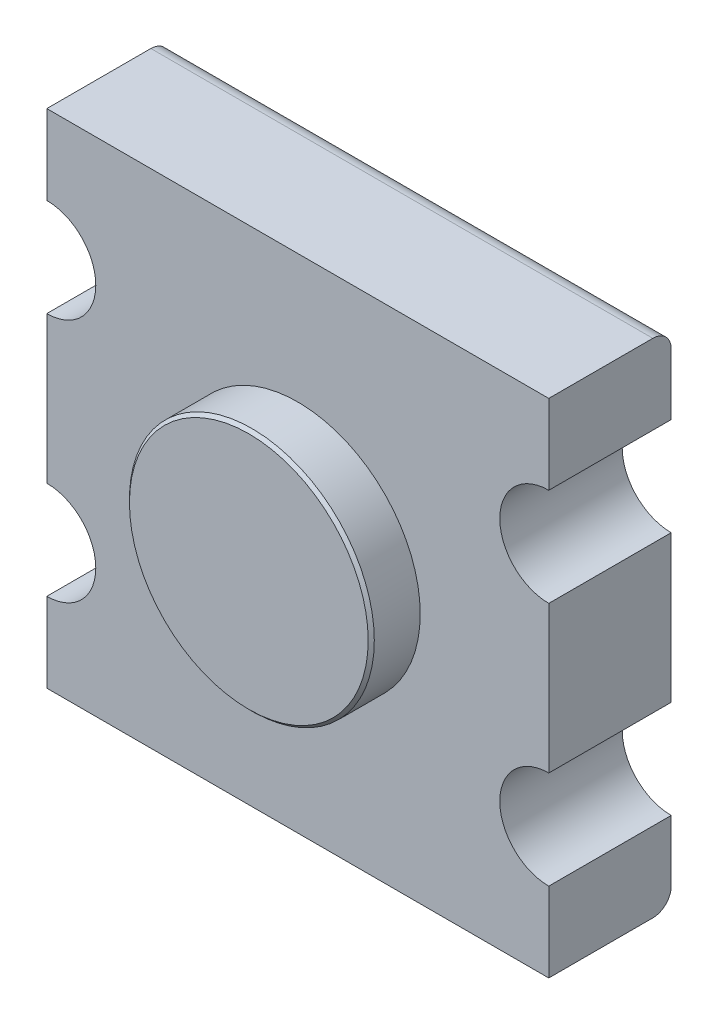
ISO-10303-21;
HEADER;
FILE_DESCRIPTION(('STEP AP214'),'2;1');
FILE_NAME('part.step','',(''),(''),'','','');
FILE_SCHEMA(('AUTOMOTIVE_DESIGN { 1 0 10303 214 1 1 1 1 }'));
ENDSEC;
DATA;
#1=APPLICATION_CONTEXT('core data for automotive mechanical design processes');
#2=APPLICATION_PROTOCOL_DEFINITION('international standard','automotive_design',2000,#1);
#3=PRODUCT_CONTEXT('',#1,'mechanical');
#4=PRODUCT('Part','Part','',(#3));
#5=PRODUCT_RELATED_PRODUCT_CATEGORY('part','',(#4));
#6=PRODUCT_DEFINITION_FORMATION('','',#4);
#7=PRODUCT_DEFINITION_CONTEXT('part definition',#1,'design');
#8=PRODUCT_DEFINITION('design','',#6,#7);
#9=PRODUCT_DEFINITION_SHAPE('','',#8);
#10=(LENGTH_UNIT() NAMED_UNIT(*) SI_UNIT(.MILLI.,.METRE.));
#11=(NAMED_UNIT(*) PLANE_ANGLE_UNIT() SI_UNIT($,.RADIAN.));
#12=(NAMED_UNIT(*) SI_UNIT($,.STERADIAN.) SOLID_ANGLE_UNIT());
#13=UNCERTAINTY_MEASURE_WITH_UNIT(LENGTH_MEASURE(1.E-05),#10,'distance_accuracy_value','');
#14=(GEOMETRIC_REPRESENTATION_CONTEXT(3) GLOBAL_UNCERTAINTY_ASSIGNED_CONTEXT((#13)) GLOBAL_UNIT_ASSIGNED_CONTEXT((#10,
#11,#12)) REPRESENTATION_CONTEXT('',''));
#15=CARTESIAN_POINT('',(0.,0.,0.));
#16=DIRECTION('',(0.,0.,1.));
#17=DIRECTION('',(1.,0.,0.));
#18=AXIS2_PLACEMENT_3D('',#15,#16,#17);
#19=CARTESIAN_POINT('',(0.,0.,20.));
#20=DIRECTION('',(1.,0.,0.));
#21=DIRECTION('',(0.,0.,-1.));
#22=AXIS2_PLACEMENT_3D('',#19,#20,#21);
#23=PLANE('',#22);
#24=DIRECTION('',(0.,-1.,0.));
#25=VECTOR('',#24,1.);
#26=CARTESIAN_POINT('',(0.,0.,0.));
#27=LINE('',#26,#25);
#28=CARTESIAN_POINT('',(0.,13.,0.));
#29=VERTEX_POINT('',#28);
#30=CARTESIAN_POINT('',(0.,3.,0.));
#31=VERTEX_POINT('',#30);
#32=EDGE_CURVE('E269',#29,#31,#27,.T.);
#33=ORIENTED_EDGE('',*,*,#32,.T.);
#34=CARTESIAN_POINT('',(0.,3.,3.));
#35=DIRECTION('',(1.,0.,0.));
#36=DIRECTION('',(0.,0.,-1.));
#37=AXIS2_PLACEMENT_3D('',#34,#35,#36);
#38=CIRCLE('',#37,3.);
#39=CARTESIAN_POINT('',(0.,0.,3.));
#40=VERTEX_POINT('',#39);
#41=EDGE_CURVE('E170',#31,#40,#38,.F.);
#42=ORIENTED_EDGE('',*,*,#41,.T.);
#43=DIRECTION('',(0.,0.,-1.));
#44=VECTOR('',#43,1.);
#45=CARTESIAN_POINT('',(0.,0.,20.));
#46=LINE('',#45,#44);
#47=CARTESIAN_POINT('',(0.,0.,20.));
#48=VERTEX_POINT('',#47);
#49=EDGE_CURVE('E148',#48,#40,#46,.T.);
#50=ORIENTED_EDGE('',*,*,#49,.F.);
#51=DIRECTION('',(0.,-1.,0.));
#52=VECTOR('',#51,1.);
#53=CARTESIAN_POINT('',(0.,0.,20.));
#54=LINE('',#53,#52);
#55=CARTESIAN_POINT('',(0.,13.,20.));
#56=VERTEX_POINT('',#55);
#57=EDGE_CURVE('E156',#56,#48,#54,.T.);
#58=ORIENTED_EDGE('',*,*,#57,.F.);
#59=DIRECTION('',(0.,0.,-1.));
#60=VECTOR('',#59,1.);
#61=CARTESIAN_POINT('',(0.,13.,20.));
#62=LINE('',#61,#60);
#63=EDGE_CURVE('E284',#56,#29,#62,.T.);
#64=ORIENTED_EDGE('',*,*,#63,.T.);
#65=EDGE_LOOP('',(#33,#42,#50,#58,#64));
#66=FACE_BOUND('',#65,.T.);
#67=ADVANCED_FACE('F41',(#66),#23,.F.);
#68=CARTESIAN_POINT('',(0.,0.,20.));
#69=DIRECTION('',(0.,1.,0.));
#70=DIRECTION('',(0.,0.,1.));
#71=AXIS2_PLACEMENT_3D('',#68,#69,#70);
#72=PLANE('',#71);
#73=ORIENTED_EDGE('',*,*,#49,.T.);
#74=DIRECTION('',(1.,0.,0.));
#75=VECTOR('',#74,1.);
#76=CARTESIAN_POINT('',(0.,0.,3.));
#77=LINE('',#76,#75);
#78=CARTESIAN_POINT('',(82.,0.,3.));
#79=VERTEX_POINT('',#78);
#80=EDGE_CURVE('E186',#40,#79,#77,.T.);
#81=ORIENTED_EDGE('',*,*,#80,.T.);
#82=DIRECTION('',(0.,0.,-1.));
#83=VECTOR('',#82,1.);
#84=CARTESIAN_POINT('',(82.,0.,20.));
#85=LINE('',#84,#83);
#86=CARTESIAN_POINT('',(82.,0.,20.));
#87=VERTEX_POINT('',#86);
#88=EDGE_CURVE('E151',#87,#79,#85,.T.);
#89=ORIENTED_EDGE('',*,*,#88,.F.);
#90=DIRECTION('',(1.,0.,0.));
#91=VECTOR('',#90,1.);
#92=CARTESIAN_POINT('',(0.,0.,20.));
#93=LINE('',#92,#91);
#94=EDGE_CURVE('E143',#48,#87,#93,.T.);
#95=ORIENTED_EDGE('',*,*,#94,.F.);
#96=EDGE_LOOP('',(#73,#81,#89,#95));
#97=FACE_BOUND('',#96,.T.);
#98=ADVANCED_FACE('F145',(#97),#72,.F.);
#99=CARTESIAN_POINT('',(82.,0.,20.));
#100=DIRECTION('',(-1.,0.,0.));
#101=DIRECTION('',(0.,0.,1.));
#102=AXIS2_PLACEMENT_3D('',#99,#100,#101);
#103=PLANE('',#102);
#104=ORIENTED_EDGE('',*,*,#88,.T.);
#105=CARTESIAN_POINT('',(82.,3.,3.));
#106=DIRECTION('',(-1.,0.,0.));
#107=DIRECTION('',(0.,0.,1.));
#108=AXIS2_PLACEMENT_3D('',#105,#106,#107);
#109=CIRCLE('',#108,3.);
#110=CARTESIAN_POINT('',(82.,3.,0.));
#111=VERTEX_POINT('',#110);
#112=EDGE_CURVE('E189',#79,#111,#109,.F.);
#113=ORIENTED_EDGE('',*,*,#112,.T.);
#114=DIRECTION('',(0.,1.,0.));
#115=VECTOR('',#114,1.);
#116=CARTESIAN_POINT('',(82.,0.,0.));
#117=LINE('',#116,#115);
#118=CARTESIAN_POINT('',(82.,13.,0.));
#119=VERTEX_POINT('',#118);
#120=EDGE_CURVE('E259',#111,#119,#117,.T.);
#121=ORIENTED_EDGE('',*,*,#120,.T.);
#122=DIRECTION('',(0.,0.,-1.));
#123=VECTOR('',#122,1.);
#124=CARTESIAN_POINT('',(82.,13.,20.));
#125=LINE('',#124,#123);
#126=CARTESIAN_POINT('',(82.,13.,20.));
#127=VERTEX_POINT('',#126);
#128=EDGE_CURVE('E179',#127,#119,#125,.T.);
#129=ORIENTED_EDGE('',*,*,#128,.F.);
#130=DIRECTION('',(0.,1.,0.));
#131=VECTOR('',#130,1.);
#132=CARTESIAN_POINT('',(82.,0.,20.));
#133=LINE('',#132,#131);
#134=EDGE_CURVE('E155',#87,#127,#133,.T.);
#135=ORIENTED_EDGE('',*,*,#134,.F.);
#136=EDGE_LOOP('',(#104,#113,#121,#129,#135));
#137=FACE_BOUND('',#136,.T.);
#138=ADVANCED_FACE('F342',(#137),#103,.F.);
#139=CARTESIAN_POINT('',(82.,21.,20.));
#140=DIRECTION('',(0.,0.,-1.));
#141=DIRECTION('',(-1.,0.,0.));
#142=AXIS2_PLACEMENT_3D('',#139,#140,#141);
#143=CYLINDRICAL_SURFACE('',#142,8.);
#144=CARTESIAN_POINT('',(82.,21.,0.));
#145=DIRECTION('',(0.,0.,-1.));
#146=DIRECTION('',(1.,0.,0.));
#147=AXIS2_PLACEMENT_3D('',#144,#145,#146);
#148=CIRCLE('',#147,8.);
#149=CARTESIAN_POINT('',(82.,29.,0.));
#150=VERTEX_POINT('',#149);
#151=EDGE_CURVE('E255',#119,#150,#148,.T.);
#152=ORIENTED_EDGE('',*,*,#151,.T.);
#153=DIRECTION('',(0.,0.,-1.));
#154=VECTOR('',#153,1.);
#155=CARTESIAN_POINT('',(82.,29.,20.));
#156=LINE('',#155,#154);
#157=CARTESIAN_POINT('',(82.,29.,20.));
#158=VERTEX_POINT('',#157);
#159=EDGE_CURVE('E244',#158,#150,#156,.T.);
#160=ORIENTED_EDGE('',*,*,#159,.F.);
#161=CARTESIAN_POINT('',(82.,21.,20.));
#162=DIRECTION('',(0.,0.,-1.));
#163=DIRECTION('',(1.,0.,0.));
#164=AXIS2_PLACEMENT_3D('',#161,#162,#163);
#165=CIRCLE('',#164,8.);
#166=EDGE_CURVE('E256',#127,#158,#165,.T.);
#167=ORIENTED_EDGE('',*,*,#166,.F.);
#168=ORIENTED_EDGE('',*,*,#128,.T.);
#169=EDGE_LOOP('',(#152,#160,#167,#168));
#170=FACE_BOUND('',#169,.T.);
#171=ADVANCED_FACE('F253',(#170),#143,.F.);
#172=CARTESIAN_POINT('',(82.,29.,20.));
#173=DIRECTION('',(-1.,0.,0.));
#174=DIRECTION('',(0.,0.,1.));
#175=AXIS2_PLACEMENT_3D('',#172,#173,#174);
#176=PLANE('',#175);
#177=DIRECTION('',(0.,1.,0.));
#178=VECTOR('',#177,1.);
#179=CARTESIAN_POINT('',(82.,29.,0.));
#180=LINE('',#179,#178);
#181=CARTESIAN_POINT('',(82.,53.,0.));
#182=VERTEX_POINT('',#181);
#183=EDGE_CURVE('E262',#150,#182,#180,.T.);
#184=ORIENTED_EDGE('',*,*,#183,.T.);
#185=DIRECTION('',(0.,0.,-1.));
#186=VECTOR('',#185,1.);
#187=CARTESIAN_POINT('',(82.,53.,20.));
#188=LINE('',#187,#186);
#189=CARTESIAN_POINT('',(82.,53.,20.));
#190=VERTEX_POINT('',#189);
#191=EDGE_CURVE('E235',#190,#182,#188,.T.);
#192=ORIENTED_EDGE('',*,*,#191,.F.);
#193=DIRECTION('',(0.,1.,0.));
#194=VECTOR('',#193,1.);
#195=CARTESIAN_POINT('',(82.,29.,20.));
#196=LINE('',#195,#194);
#197=EDGE_CURVE('E327',#158,#190,#196,.T.);
#198=ORIENTED_EDGE('',*,*,#197,.F.);
#199=ORIENTED_EDGE('',*,*,#159,.T.);
#200=EDGE_LOOP('',(#184,#192,#198,#199));
#201=FACE_BOUND('',#200,.T.);
#202=ADVANCED_FACE('F341',(#201),#176,.F.);
#203=CARTESIAN_POINT('',(82.,61.,20.));
#204=DIRECTION('',(0.,0.,-1.));
#205=DIRECTION('',(-1.,0.,0.));
#206=AXIS2_PLACEMENT_3D('',#203,#204,#205);
#207=CYLINDRICAL_SURFACE('',#206,8.);
#208=CARTESIAN_POINT('',(82.,61.,0.));
#209=DIRECTION('',(0.,0.,-1.));
#210=DIRECTION('',(1.,0.,0.));
#211=AXIS2_PLACEMENT_3D('',#208,#209,#210);
#212=CIRCLE('',#211,8.);
#213=CARTESIAN_POINT('',(82.,69.,0.));
#214=VERTEX_POINT('',#213);
#215=EDGE_CURVE('E267',#182,#214,#212,.T.);
#216=ORIENTED_EDGE('',*,*,#215,.T.);
#217=DIRECTION('',(0.,0.,-1.));
#218=VECTOR('',#217,1.);
#219=CARTESIAN_POINT('',(82.,69.,20.));
#220=LINE('',#219,#218);
#221=CARTESIAN_POINT('',(82.,69.,20.));
#222=VERTEX_POINT('',#221);
#223=EDGE_CURVE('E230',#222,#214,#220,.T.);
#224=ORIENTED_EDGE('',*,*,#223,.F.);
#225=CARTESIAN_POINT('',(82.,61.,20.));
#226=DIRECTION('',(0.,0.,-1.));
#227=DIRECTION('',(1.,0.,0.));
#228=AXIS2_PLACEMENT_3D('',#225,#226,#227);
#229=CIRCLE('',#228,8.);
#230=EDGE_CURVE('E330',#190,#222,#229,.T.);
#231=ORIENTED_EDGE('',*,*,#230,.F.);
#232=ORIENTED_EDGE('',*,*,#191,.T.);
#233=EDGE_LOOP('',(#216,#224,#231,#232));
#234=FACE_BOUND('',#233,.T.);
#235=ADVANCED_FACE('F337',(#234),#207,.F.);
#236=CARTESIAN_POINT('',(82.,69.,20.));
#237=DIRECTION('',(-1.,0.,0.));
#238=DIRECTION('',(0.,0.,1.));
#239=AXIS2_PLACEMENT_3D('',#236,#237,#238);
#240=PLANE('',#239);
#241=DIRECTION('',(0.,1.,0.));
#242=VECTOR('',#241,1.);
#243=CARTESIAN_POINT('',(82.,69.,0.));
#244=LINE('',#243,#242);
#245=CARTESIAN_POINT('',(82.,79.,0.));
#246=VERTEX_POINT('',#245);
#247=EDGE_CURVE('E221',#214,#246,#244,.T.);
#248=ORIENTED_EDGE('',*,*,#247,.T.);
#249=CARTESIAN_POINT('',(82.,79.,3.));
#250=DIRECTION('',(-1.,0.,0.));
#251=DIRECTION('',(0.,0.,1.));
#252=AXIS2_PLACEMENT_3D('',#249,#250,#251);
#253=CIRCLE('',#252,3.);
#254=CARTESIAN_POINT('',(82.,82.,3.));
#255=VERTEX_POINT('',#254);
#256=EDGE_CURVE('E11',#246,#255,#253,.F.);
#257=ORIENTED_EDGE('',*,*,#256,.T.);
#258=DIRECTION('',(0.,0.,-1.));
#259=VECTOR('',#258,1.);
#260=CARTESIAN_POINT('',(82.,82.,20.));
#261=LINE('',#260,#259);
#262=CARTESIAN_POINT('',(82.,82.,20.));
#263=VERTEX_POINT('',#262);
#264=EDGE_CURVE('E226',#263,#255,#261,.T.);
#265=ORIENTED_EDGE('',*,*,#264,.F.);
#266=DIRECTION('',(0.,1.,0.));
#267=VECTOR('',#266,1.);
#268=CARTESIAN_POINT('',(82.,69.,20.));
#269=LINE('',#268,#267);
#270=EDGE_CURVE('E307',#222,#263,#269,.T.);
#271=ORIENTED_EDGE('',*,*,#270,.F.);
#272=ORIENTED_EDGE('',*,*,#223,.T.);
#273=EDGE_LOOP('',(#248,#257,#265,#271,#272));
#274=FACE_BOUND('',#273,.T.);
#275=ADVANCED_FACE('F335',(#274),#240,.F.);
#276=CARTESIAN_POINT('',(0.,82.,20.));
#277=DIRECTION('',(0.,-1.,0.));
#278=DIRECTION('',(0.,0.,-1.));
#279=AXIS2_PLACEMENT_3D('',#276,#277,#278);
#280=PLANE('',#279);
#281=ORIENTED_EDGE('',*,*,#264,.T.);
#282=DIRECTION('',(-1.,0.,0.));
#283=VECTOR('',#282,1.);
#284=CARTESIAN_POINT('',(0.,82.,3.));
#285=LINE('',#284,#283);
#286=CARTESIAN_POINT('',(0.,82.,3.));
#287=VERTEX_POINT('',#286);
#288=EDGE_CURVE('E200',#255,#287,#285,.T.);
#289=ORIENTED_EDGE('',*,*,#288,.T.);
#290=DIRECTION('',(0.,0.,-1.));
#291=VECTOR('',#290,1.);
#292=CARTESIAN_POINT('',(0.,82.,20.));
#293=LINE('',#292,#291);
#294=CARTESIAN_POINT('',(0.,82.,20.));
#295=VERTEX_POINT('',#294);
#296=EDGE_CURVE('E212',#295,#287,#293,.T.);
#297=ORIENTED_EDGE('',*,*,#296,.F.);
#298=DIRECTION('',(-1.,0.,0.));
#299=VECTOR('',#298,1.);
#300=CARTESIAN_POINT('',(0.,82.,20.));
#301=LINE('',#300,#299);
#302=EDGE_CURVE('E227',#263,#295,#301,.T.);
#303=ORIENTED_EDGE('',*,*,#302,.F.);
#304=EDGE_LOOP('',(#281,#289,#297,#303));
#305=FACE_BOUND('',#304,.T.);
#306=ADVANCED_FACE('F224',(#305),#280,.F.);
#307=CARTESIAN_POINT('',(0.,69.,20.));
#308=DIRECTION('',(1.,0.,0.));
#309=DIRECTION('',(0.,0.,-1.));
#310=AXIS2_PLACEMENT_3D('',#307,#308,#309);
#311=PLANE('',#310);
#312=ORIENTED_EDGE('',*,*,#296,.T.);
#313=CARTESIAN_POINT('',(0.,79.,3.));
#314=DIRECTION('',(1.,0.,0.));
#315=DIRECTION('',(0.,0.,-1.));
#316=AXIS2_PLACEMENT_3D('',#313,#314,#315);
#317=CIRCLE('',#316,3.);
#318=CARTESIAN_POINT('',(0.,79.,0.));
#319=VERTEX_POINT('',#318);
#320=EDGE_CURVE('E50',#287,#319,#317,.F.);
#321=ORIENTED_EDGE('',*,*,#320,.T.);
#322=DIRECTION('',(0.,-1.,0.));
#323=VECTOR('',#322,1.);
#324=CARTESIAN_POINT('',(0.,69.,0.));
#325=LINE('',#324,#323);
#326=CARTESIAN_POINT('',(0.,69.,0.));
#327=VERTEX_POINT('',#326);
#328=EDGE_CURVE('E208',#319,#327,#325,.T.);
#329=ORIENTED_EDGE('',*,*,#328,.T.);
#330=DIRECTION('',(0.,0.,-1.));
#331=VECTOR('',#330,1.);
#332=CARTESIAN_POINT('',(0.,69.,20.));
#333=LINE('',#332,#331);
#334=CARTESIAN_POINT('',(0.,69.,20.));
#335=VERTEX_POINT('',#334);
#336=EDGE_CURVE('E237',#335,#327,#333,.T.);
#337=ORIENTED_EDGE('',*,*,#336,.F.);
#338=DIRECTION('',(0.,-1.,0.));
#339=VECTOR('',#338,1.);
#340=CARTESIAN_POINT('',(0.,69.,20.));
#341=LINE('',#340,#339);
#342=EDGE_CURVE('E300',#295,#335,#341,.T.);
#343=ORIENTED_EDGE('',*,*,#342,.F.);
#344=EDGE_LOOP('',(#312,#321,#329,#337,#343));
#345=FACE_BOUND('',#344,.T.);
#346=ADVANCED_FACE('F206',(#345),#311,.F.);
#347=CARTESIAN_POINT('',(0.,61.,20.));
#348=DIRECTION('',(0.,0.,-1.));
#349=DIRECTION('',(-1.,0.,0.));
#350=AXIS2_PLACEMENT_3D('',#347,#348,#349);
#351=CYLINDRICAL_SURFACE('',#350,8.);
#352=CARTESIAN_POINT('',(0.,61.,0.));
#353=DIRECTION('',(0.,0.,-1.));
#354=DIRECTION('',(1.,0.,0.));
#355=AXIS2_PLACEMENT_3D('',#352,#353,#354);
#356=CIRCLE('',#355,8.);
#357=CARTESIAN_POINT('',(0.,53.,0.));
#358=VERTEX_POINT('',#357);
#359=EDGE_CURVE('E219',#327,#358,#356,.T.);
#360=ORIENTED_EDGE('',*,*,#359,.T.);
#361=DIRECTION('',(0.,0.,-1.));
#362=VECTOR('',#361,1.);
#363=CARTESIAN_POINT('',(0.,53.,20.));
#364=LINE('',#363,#362);
#365=CARTESIAN_POINT('',(0.,53.,20.));
#366=VERTEX_POINT('',#365);
#367=EDGE_CURVE('E291',#366,#358,#364,.T.);
#368=ORIENTED_EDGE('',*,*,#367,.F.);
#369=CARTESIAN_POINT('',(0.,61.,20.));
#370=DIRECTION('',(0.,0.,-1.));
#371=DIRECTION('',(1.,0.,0.));
#372=AXIS2_PLACEMENT_3D('',#369,#370,#371);
#373=CIRCLE('',#372,8.);
#374=EDGE_CURVE('E299',#335,#366,#373,.T.);
#375=ORIENTED_EDGE('',*,*,#374,.F.);
#376=ORIENTED_EDGE('',*,*,#336,.T.);
#377=EDGE_LOOP('',(#360,#368,#375,#376));
#378=FACE_BOUND('',#377,.T.);
#379=ADVANCED_FACE('F297',(#378),#351,.F.);
#380=CARTESIAN_POINT('',(0.,29.,20.));
#381=DIRECTION('',(1.,0.,0.));
#382=DIRECTION('',(0.,0.,-1.));
#383=AXIS2_PLACEMENT_3D('',#380,#381,#382);
#384=PLANE('',#383);
#385=DIRECTION('',(0.,-1.,0.));
#386=VECTOR('',#385,1.);
#387=CARTESIAN_POINT('',(0.,29.,0.));
#388=LINE('',#387,#386);
#389=CARTESIAN_POINT('',(0.,29.,0.));
#390=VERTEX_POINT('',#389);
#391=EDGE_CURVE('E279',#358,#390,#388,.T.);
#392=ORIENTED_EDGE('',*,*,#391,.T.);
#393=DIRECTION('',(0.,0.,-1.));
#394=VECTOR('',#393,1.);
#395=CARTESIAN_POINT('',(0.,29.,20.));
#396=LINE('',#395,#394);
#397=CARTESIAN_POINT('',(0.,29.,20.));
#398=VERTEX_POINT('',#397);
#399=EDGE_CURVE('E287',#398,#390,#396,.T.);
#400=ORIENTED_EDGE('',*,*,#399,.F.);
#401=DIRECTION('',(0.,-1.,0.));
#402=VECTOR('',#401,1.);
#403=CARTESIAN_POINT('',(0.,29.,20.));
#404=LINE('',#403,#402);
#405=EDGE_CURVE('E305',#366,#398,#404,.T.);
#406=ORIENTED_EDGE('',*,*,#405,.F.);
#407=ORIENTED_EDGE('',*,*,#367,.T.);
#408=EDGE_LOOP('',(#392,#400,#406,#407));
#409=FACE_BOUND('',#408,.T.);
#410=ADVANCED_FACE('F351',(#409),#384,.F.);
#411=CARTESIAN_POINT('',(0.,21.,20.));
#412=DIRECTION('',(0.,0.,-1.));
#413=DIRECTION('',(-1.,0.,0.));
#414=AXIS2_PLACEMENT_3D('',#411,#412,#413);
#415=CYLINDRICAL_SURFACE('',#414,8.);
#416=CARTESIAN_POINT('',(0.,21.,0.));
#417=DIRECTION('',(0.,0.,-1.));
#418=DIRECTION('',(1.,0.,0.));
#419=AXIS2_PLACEMENT_3D('',#416,#417,#418);
#420=CIRCLE('',#419,8.);
#421=EDGE_CURVE('E166',#390,#29,#420,.T.);
#422=ORIENTED_EDGE('',*,*,#421,.T.);
#423=ORIENTED_EDGE('',*,*,#63,.F.);
#424=CARTESIAN_POINT('',(0.,21.,20.));
#425=DIRECTION('',(0.,0.,-1.));
#426=DIRECTION('',(1.,0.,0.));
#427=AXIS2_PLACEMENT_3D('',#424,#425,#426);
#428=CIRCLE('',#427,8.);
#429=EDGE_CURVE('E161',#398,#56,#428,.T.);
#430=ORIENTED_EDGE('',*,*,#429,.F.);
#431=ORIENTED_EDGE('',*,*,#399,.T.);
#432=EDGE_LOOP('',(#422,#423,#430,#431));
#433=FACE_BOUND('',#432,.T.);
#434=ADVANCED_FACE('F347',(#433),#415,.F.);
#435=CARTESIAN_POINT('',(0.,21.,20.));
#436=DIRECTION('',(0.,0.,1.));
#437=DIRECTION('',(1.,0.,0.));
#438=AXIS2_PLACEMENT_3D('',#435,#436,#437);
#439=PLANE('',#438);
#440=CARTESIAN_POINT('',(41.,41.,20.));
#441=DIRECTION('',(0.,0.,1.));
#442=DIRECTION('',(1.,0.,0.));
#443=AXIS2_PLACEMENT_3D('',#440,#441,#442);
#444=CIRCLE('',#443,20.);
#445=CARTESIAN_POINT('',(61.,41.,20.));
#446=VERTEX_POINT('',#445);
#447=EDGE_CURVE('E315',#446,#446,#444,.T.);
#448=ORIENTED_EDGE('',*,*,#447,.F.);
#449=EDGE_LOOP('',(#448));
#450=FACE_BOUND('',#449,.T.);
#451=ORIENTED_EDGE('',*,*,#57,.T.);
#452=ORIENTED_EDGE('',*,*,#94,.T.);
#453=ORIENTED_EDGE('',*,*,#134,.T.);
#454=ORIENTED_EDGE('',*,*,#166,.T.);
#455=ORIENTED_EDGE('',*,*,#197,.T.);
#456=ORIENTED_EDGE('',*,*,#230,.T.);
#457=ORIENTED_EDGE('',*,*,#270,.T.);
#458=ORIENTED_EDGE('',*,*,#302,.T.);
#459=ORIENTED_EDGE('',*,*,#342,.T.);
#460=ORIENTED_EDGE('',*,*,#374,.T.);
#461=ORIENTED_EDGE('',*,*,#405,.T.);
#462=ORIENTED_EDGE('',*,*,#429,.T.);
#463=EDGE_LOOP('',(#451,#452,#453,#454,#455,#456,#457,#458,#459,#460,#461,#462));
#464=FACE_BOUND('',#463,.T.);
#465=ADVANCED_FACE('F159',(#450,#464),#439,.T.);
#466=CARTESIAN_POINT('',(0.,21.,0.));
#467=DIRECTION('',(0.,0.,1.));
#468=DIRECTION('',(1.,0.,0.));
#469=AXIS2_PLACEMENT_3D('',#466,#467,#468);
#470=PLANE('',#469);
#471=ORIENTED_EDGE('',*,*,#120,.F.);
#472=DIRECTION('',(1.,0.,0.));
#473=VECTOR('',#472,1.);
#474=CARTESIAN_POINT('',(0.,3.,0.));
#475=LINE('',#474,#473);
#476=EDGE_CURVE('E195',#111,#31,#475,.F.);
#477=ORIENTED_EDGE('',*,*,#476,.T.);
#478=ORIENTED_EDGE('',*,*,#32,.F.);
#479=ORIENTED_EDGE('',*,*,#421,.F.);
#480=ORIENTED_EDGE('',*,*,#391,.F.);
#481=ORIENTED_EDGE('',*,*,#359,.F.);
#482=ORIENTED_EDGE('',*,*,#328,.F.);
#483=DIRECTION('',(-1.,0.,0.));
#484=VECTOR('',#483,1.);
#485=CARTESIAN_POINT('',(0.,79.,0.));
#486=LINE('',#485,#484);
#487=EDGE_CURVE('E192',#319,#246,#486,.F.);
#488=ORIENTED_EDGE('',*,*,#487,.T.);
#489=ORIENTED_EDGE('',*,*,#247,.F.);
#490=ORIENTED_EDGE('',*,*,#215,.F.);
#491=ORIENTED_EDGE('',*,*,#183,.F.);
#492=ORIENTED_EDGE('',*,*,#151,.F.);
#493=EDGE_LOOP('',(#471,#477,#478,#479,#480,#481,#482,#488,#489,#490,#491,#492));
#494=FACE_BOUND('',#493,.T.);
#495=ADVANCED_FACE('F216',(#494),#470,.F.);
#496=CARTESIAN_POINT('',(41.,41.,28.));
#497=DIRECTION('',(0.,0.,-1.));
#498=DIRECTION('',(-1.,0.,0.));
#499=AXIS2_PLACEMENT_3D('',#496,#497,#498);
#500=CYLINDRICAL_SURFACE('',#499,20.);
#501=CARTESIAN_POINT('',(41.,41.,27.5));
#502=DIRECTION('',(0.,0.,1.));
#503=DIRECTION('',(1.,0.,0.));
#504=AXIS2_PLACEMENT_3D('',#501,#502,#503);
#505=CIRCLE('',#504,20.);
#506=CARTESIAN_POINT('',(61.,41.,27.5));
#507=VERTEX_POINT('',#506);
#508=EDGE_CURVE('E177',#507,#507,#505,.F.);
#509=ORIENTED_EDGE('',*,*,#508,.T.);
#510=EDGE_LOOP('',(#509));
#511=FACE_BOUND('',#510,.T.);
#512=ORIENTED_EDGE('',*,*,#447,.T.);
#513=EDGE_LOOP('',(#512));
#514=FACE_BOUND('',#513,.T.);
#515=ADVANCED_FACE('F395',(#511,#514),#500,.T.);
#516=CARTESIAN_POINT('',(41.,41.,28.));
#517=DIRECTION('',(0.,0.,1.));
#518=DIRECTION('',(1.,0.,0.));
#519=AXIS2_PLACEMENT_3D('',#516,#517,#518);
#520=PLANE('',#519);
#521=CARTESIAN_POINT('',(41.,41.,28.));
#522=DIRECTION('',(0.,0.,1.));
#523=DIRECTION('',(1.,0.,0.));
#524=AXIS2_PLACEMENT_3D('',#521,#522,#523);
#525=CIRCLE('',#524,19.5);
#526=CARTESIAN_POINT('',(60.5,41.,28.));
#527=VERTEX_POINT('',#526);
#528=EDGE_CURVE('E172',#527,#527,#525,.T.);
#529=ORIENTED_EDGE('',*,*,#528,.T.);
#530=EDGE_LOOP('',(#529));
#531=FACE_BOUND('',#530,.T.);
#532=ADVANCED_FACE('F373',(#531),#520,.T.);
#533=CARTESIAN_POINT('',(41.,41.,28.));
#534=DIRECTION('',(0.,0.,-1.));
#535=DIRECTION('',(-1.,0.,0.));
#536=AXIS2_PLACEMENT_3D('',#533,#534,#535);
#537=CONICAL_SURFACE('',#536,19.5,0.785398163397448);
#538=ORIENTED_EDGE('',*,*,#508,.F.);
#539=EDGE_LOOP('',(#538));
#540=FACE_BOUND('',#539,.T.);
#541=ORIENTED_EDGE('',*,*,#528,.F.);
#542=EDGE_LOOP('',(#541));
#543=FACE_BOUND('',#542,.T.);
#544=ADVANCED_FACE('F369',(#540,#543),#537,.T.);
#545=CARTESIAN_POINT('',(0.,3.,3.));
#546=DIRECTION('',(1.,0.,0.));
#547=DIRECTION('',(0.,0.,-1.));
#548=AXIS2_PLACEMENT_3D('',#545,#546,#547);
#549=CYLINDRICAL_SURFACE('',#548,3.);
#550=ORIENTED_EDGE('',*,*,#41,.F.);
#551=ORIENTED_EDGE('',*,*,#476,.F.);
#552=ORIENTED_EDGE('',*,*,#112,.F.);
#553=ORIENTED_EDGE('',*,*,#80,.F.);
#554=EDGE_LOOP('',(#550,#551,#552,#553));
#555=FACE_BOUND('',#554,.T.);
#556=ADVANCED_FACE('F344',(#555),#549,.T.);
#557=CARTESIAN_POINT('',(0.,79.,3.));
#558=DIRECTION('',(-1.,0.,0.));
#559=DIRECTION('',(0.,0.,1.));
#560=AXIS2_PLACEMENT_3D('',#557,#558,#559);
#561=CYLINDRICAL_SURFACE('',#560,3.);
#562=ORIENTED_EDGE('',*,*,#256,.F.);
#563=ORIENTED_EDGE('',*,*,#487,.F.);
#564=ORIENTED_EDGE('',*,*,#320,.F.);
#565=ORIENTED_EDGE('',*,*,#288,.F.);
#566=EDGE_LOOP('',(#562,#563,#564,#565));
#567=FACE_BOUND('',#566,.T.);
#568=ADVANCED_FACE('F43',(#567),#561,.T.);
#569=CLOSED_SHELL('',(#67,#98,#138,#171,#202,#235,#275,#306,#346,#379,#410,#434,#465,#495,#515,
#532,#544,#556,#568));
#570=MANIFOLD_SOLID_BREP('B2',#569);
#571=ADVANCED_BREP_SHAPE_REPRESENTATION('',(#18,#570),#14);
#572=SHAPE_DEFINITION_REPRESENTATION(#9,#571);
ENDSEC;
END-ISO-10303-21;
